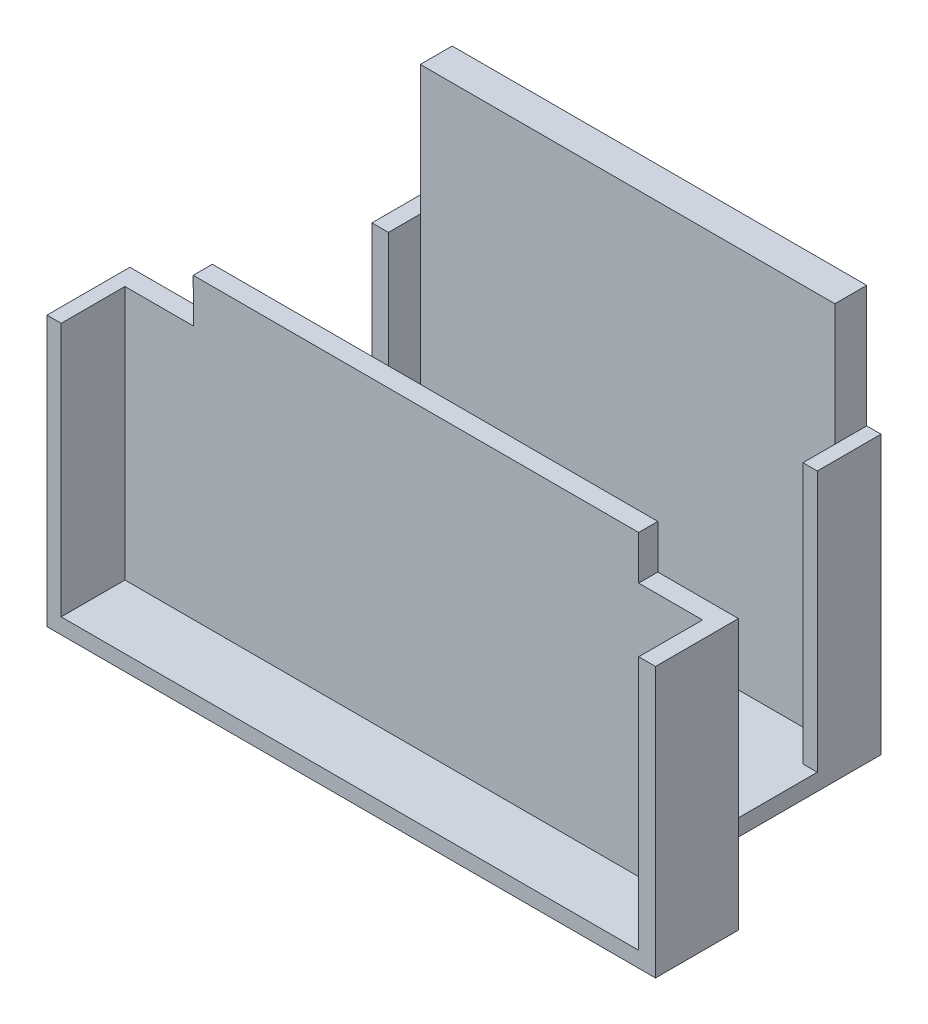
ISO-10303-21;
HEADER;
FILE_DESCRIPTION(('STEP AP214'),'2;1');
FILE_NAME('part.step','',(''),(''),'','','');
FILE_SCHEMA(('AUTOMOTIVE_DESIGN { 1 0 10303 214 1 1 1 1 }'));
ENDSEC;
DATA;
#1=APPLICATION_CONTEXT('core data for automotive mechanical design processes');
#2=APPLICATION_PROTOCOL_DEFINITION('international standard','automotive_design',2000,#1);
#3=PRODUCT_CONTEXT('',#1,'mechanical');
#4=PRODUCT('Part','Part','',(#3));
#5=PRODUCT_RELATED_PRODUCT_CATEGORY('part','',(#4));
#6=PRODUCT_DEFINITION_FORMATION('','',#4);
#7=PRODUCT_DEFINITION_CONTEXT('part definition',#1,'design');
#8=PRODUCT_DEFINITION('design','',#6,#7);
#9=PRODUCT_DEFINITION_SHAPE('','',#8);
#10=(LENGTH_UNIT() NAMED_UNIT(*) SI_UNIT(.MILLI.,.METRE.));
#11=(NAMED_UNIT(*) PLANE_ANGLE_UNIT() SI_UNIT($,.RADIAN.));
#12=(NAMED_UNIT(*) SI_UNIT($,.STERADIAN.) SOLID_ANGLE_UNIT());
#13=UNCERTAINTY_MEASURE_WITH_UNIT(LENGTH_MEASURE(1.E-05),#10,'distance_accuracy_value','');
#14=(GEOMETRIC_REPRESENTATION_CONTEXT(3) GLOBAL_UNCERTAINTY_ASSIGNED_CONTEXT((#13)) GLOBAL_UNIT_ASSIGNED_CONTEXT((#10,
#11,#12)) REPRESENTATION_CONTEXT('',''));
#15=CARTESIAN_POINT('',(0.,0.,0.));
#16=DIRECTION('',(0.,0.,1.));
#17=DIRECTION('',(1.,0.,0.));
#18=AXIS2_PLACEMENT_3D('',#15,#16,#17);
#19=CARTESIAN_POINT('',(0.,0.,38.));
#20=DIRECTION('',(0.,0.,1.));
#21=DIRECTION('',(1.,0.,0.));
#22=AXIS2_PLACEMENT_3D('',#19,#20,#21);
#23=PLANE('',#22);
#24=DIRECTION('',(1.,0.,0.));
#25=VECTOR('',#24,1.);
#26=CARTESIAN_POINT('',(0.,-16.8033230912976,38.));
#27=LINE('',#26,#25);
#28=CARTESIAN_POINT('',(-32.3877144448461,-16.8033230912976,38.));
#29=VERTEX_POINT('',#28);
#30=CARTESIAN_POINT('',(58.1736144722457,-16.8033230912976,38.));
#31=VERTEX_POINT('',#30);
#32=EDGE_CURVE('E106',#29,#31,#27,.T.);
#33=ORIENTED_EDGE('',*,*,#32,.T.);
#34=DIRECTION('',(0.,1.,0.));
#35=VECTOR('',#34,1.);
#36=CARTESIAN_POINT('',(58.1736144722457,0.,38.));
#37=LINE('',#36,#35);
#38=CARTESIAN_POINT('',(58.1736144722457,23.0615674408494,38.));
#39=VERTEX_POINT('',#38);
#40=EDGE_CURVE('E288',#31,#39,#37,.T.);
#41=ORIENTED_EDGE('',*,*,#40,.T.);
#42=DIRECTION('',(-1.,0.,0.));
#43=VECTOR('',#42,1.);
#44=CARTESIAN_POINT('',(60.8040688063837,23.0615674408494,38.));
#45=LINE('',#44,#43);
#46=CARTESIAN_POINT('',(48.1691411178828,23.0615674408494,38.));
#47=VERTEX_POINT('',#46);
#48=EDGE_CURVE('E311',#39,#47,#45,.T.);
#49=ORIENTED_EDGE('',*,*,#48,.T.);
#50=DIRECTION('',(0.,1.,0.));
#51=VECTOR('',#50,1.);
#52=CARTESIAN_POINT('',(48.1691411178828,23.0615674408494,38.));
#53=LINE('',#52,#51);
#54=CARTESIAN_POINT('',(48.1691411178828,29.9376057969843,38.));
#55=VERTEX_POINT('',#54);
#56=EDGE_CURVE('E313',#47,#55,#53,.T.);
#57=ORIENTED_EDGE('',*,*,#56,.T.);
#58=DIRECTION('',(1.,0.,0.));
#59=VECTOR('',#58,1.);
#60=CARTESIAN_POINT('',(-21.6790919441443,29.9376057969843,38.));
#61=LINE('',#60,#59);
#62=CARTESIAN_POINT('',(-21.6790919441443,29.9376057969843,38.));
#63=VERTEX_POINT('',#62);
#64=EDGE_CURVE('E316',#63,#55,#61,.T.);
#65=ORIENTED_EDGE('',*,*,#64,.F.);
#66=DIRECTION('',(-0.00187809054826046,0.999998236386391,0.));
#67=VECTOR('',#66,1.);
#68=CARTESIAN_POINT('',(-21.6661780987231,23.0615674408494,38.));
#69=LINE('',#68,#67);
#70=CARTESIAN_POINT('',(-21.6661780987231,23.0615674408494,38.));
#71=VERTEX_POINT('',#70);
#72=EDGE_CURVE('E319',#71,#63,#69,.T.);
#73=ORIENTED_EDGE('',*,*,#72,.F.);
#74=DIRECTION('',(-1.,0.,0.));
#75=VECTOR('',#74,1.);
#76=CARTESIAN_POINT('',(-21.6661780987231,23.0615674408494,38.));
#77=LINE('',#76,#75);
#78=CARTESIAN_POINT('',(-32.3877144448461,23.0615674408494,38.));
#79=VERTEX_POINT('',#78);
#80=EDGE_CURVE('E322',#71,#79,#77,.T.);
#81=ORIENTED_EDGE('',*,*,#80,.T.);
#82=DIRECTION('',(0.,-1.,0.));
#83=VECTOR('',#82,1.);
#84=CARTESIAN_POINT('',(-32.3877144448461,23.0615674408494,38.));
#85=LINE('',#84,#83);
#86=EDGE_CURVE('E282',#79,#29,#85,.T.);
#87=ORIENTED_EDGE('',*,*,#86,.T.);
#88=EDGE_LOOP('',(#33,#41,#49,#57,#65,#73,#81,#87));
#89=FACE_BOUND('',#88,.T.);
#90=ADVANCED_FACE('F91',(#89),#23,.T.);
#91=CARTESIAN_POINT('',(-19.0734380843407,0.,5.));
#92=DIRECTION('',(1.,0.,0.));
#93=DIRECTION('',(0.,1.,0.));
#94=AXIS2_PLACEMENT_3D('',#91,#92,#93);
#95=PLANE('',#94);
#96=DIRECTION('',(0.,0.,-1.));
#97=VECTOR('',#96,1.);
#98=CARTESIAN_POINT('',(-19.0734380843407,23.0615674408494,10.));
#99=LINE('',#98,#97);
#100=CARTESIAN_POINT('',(-19.0734380843407,23.0615674408494,5.));
#101=VERTEX_POINT('',#100);
#102=CARTESIAN_POINT('',(-19.0734380843407,23.0615674408494,0.));
#103=VERTEX_POINT('',#102);
#104=EDGE_CURVE('E99',#101,#103,#99,.T.);
#105=ORIENTED_EDGE('',*,*,#104,.F.);
#106=DIRECTION('',(0.,-1.,0.));
#107=VECTOR('',#106,1.);
#108=CARTESIAN_POINT('',(-19.0734380843407,0.,5.));
#109=LINE('',#108,#107);
#110=CARTESIAN_POINT('',(-19.0734380843407,43.3745188868177,5.));
#111=VERTEX_POINT('',#110);
#112=EDGE_CURVE('E450',#111,#101,#109,.T.);
#113=ORIENTED_EDGE('',*,*,#112,.F.);
#114=DIRECTION('',(0.,0.,-1.));
#115=VECTOR('',#114,1.);
#116=CARTESIAN_POINT('',(-19.0734380843407,43.3745188868177,5.));
#117=LINE('',#116,#115);
#118=CARTESIAN_POINT('',(-19.0734380843407,43.3745188868177,0.));
#119=VERTEX_POINT('',#118);
#120=EDGE_CURVE('E455',#111,#119,#117,.T.);
#121=ORIENTED_EDGE('',*,*,#120,.T.);
#122=DIRECTION('',(0.,-1.,0.));
#123=VECTOR('',#122,1.);
#124=CARTESIAN_POINT('',(-19.0734380843407,0.,0.));
#125=LINE('',#124,#123);
#126=EDGE_CURVE('E461',#119,#103,#125,.T.);
#127=ORIENTED_EDGE('',*,*,#126,.T.);
#128=EDGE_LOOP('',(#105,#113,#121,#127));
#129=FACE_BOUND('',#128,.T.);
#130=ADVANCED_FACE('F495',(#129),#95,.F.);
#131=CARTESIAN_POINT('',(45.9265619156593,0.,5.));
#132=DIRECTION('',(1.,0.,0.));
#133=DIRECTION('',(0.,1.,0.));
#134=AXIS2_PLACEMENT_3D('',#131,#132,#133);
#135=PLANE('',#134);
#136=DIRECTION('',(0.,-1.,0.));
#137=VECTOR('',#136,1.);
#138=CARTESIAN_POINT('',(45.9265619156593,0.,5.));
#139=LINE('',#138,#137);
#140=CARTESIAN_POINT('',(45.9265619156593,43.3745188868177,5.));
#141=VERTEX_POINT('',#140);
#142=CARTESIAN_POINT('',(45.9265619156593,24.287776118575,5.));
#143=VERTEX_POINT('',#142);
#144=EDGE_CURVE('E442',#141,#143,#139,.T.);
#145=ORIENTED_EDGE('',*,*,#144,.T.);
#146=DIRECTION('',(0.,0.,-1.));
#147=VECTOR('',#146,1.);
#148=CARTESIAN_POINT('',(45.9265619156593,24.287776118575,10.));
#149=LINE('',#148,#147);
#150=CARTESIAN_POINT('',(45.9265619156593,24.287776118575,0.));
#151=VERTEX_POINT('',#150);
#152=EDGE_CURVE('E441',#143,#151,#149,.T.);
#153=ORIENTED_EDGE('',*,*,#152,.T.);
#154=DIRECTION('',(0.,-1.,0.));
#155=VECTOR('',#154,1.);
#156=CARTESIAN_POINT('',(45.9265619156593,0.,0.));
#157=LINE('',#156,#155);
#158=CARTESIAN_POINT('',(45.9265619156593,43.3745188868177,0.));
#159=VERTEX_POINT('',#158);
#160=EDGE_CURVE('E436',#159,#151,#157,.T.);
#161=ORIENTED_EDGE('',*,*,#160,.F.);
#162=DIRECTION('',(0.,0.,-1.));
#163=VECTOR('',#162,1.);
#164=CARTESIAN_POINT('',(45.9265619156593,43.3745188868177,5.));
#165=LINE('',#164,#163);
#166=EDGE_CURVE('E463',#141,#159,#165,.T.);
#167=ORIENTED_EDGE('',*,*,#166,.F.);
#168=EDGE_LOOP('',(#145,#153,#161,#167));
#169=FACE_BOUND('',#168,.T.);
#170=ADVANCED_FACE('F93',(#169),#135,.T.);
#171=CARTESIAN_POINT('',(0.,0.,0.));
#172=DIRECTION('',(0.,0.,1.));
#173=DIRECTION('',(1.,0.,0.));
#174=AXIS2_PLACEMENT_3D('',#171,#172,#173);
#175=PLANE('',#174);
#176=DIRECTION('',(1.,0.,0.));
#177=VECTOR('',#176,1.);
#178=CARTESIAN_POINT('',(48.1691411178828,-16.6254811131823,0.));
#179=LINE('',#178,#177);
#180=CARTESIAN_POINT('',(-21.6790919441443,-16.6254811131823,0.));
#181=VERTEX_POINT('',#180);
#182=CARTESIAN_POINT('',(-21.6661780987231,-16.6254811131823,0.));
#183=VERTEX_POINT('',#182);
#184=EDGE_CURVE('E371',#181,#183,#179,.T.);
#185=ORIENTED_EDGE('',*,*,#184,.T.);
#186=DIRECTION('',(0.,1.,0.));
#187=VECTOR('',#186,1.);
#188=CARTESIAN_POINT('',(-21.6661780987231,23.0615674408494,0.));
#189=LINE('',#188,#187);
#190=CARTESIAN_POINT('',(-21.6661780987231,23.0615674408494,0.));
#191=VERTEX_POINT('',#190);
#192=EDGE_CURVE('E395',#183,#191,#189,.T.);
#193=ORIENTED_EDGE('',*,*,#192,.T.);
#194=DIRECTION('',(1.,0.,0.));
#195=VECTOR('',#194,1.);
#196=CARTESIAN_POINT('',(-19.0734380843407,23.0615674408494,0.));
#197=LINE('',#196,#195);
#198=EDGE_CURVE('E399',#191,#103,#197,.T.);
#199=ORIENTED_EDGE('',*,*,#198,.T.);
#200=ORIENTED_EDGE('',*,*,#126,.F.);
#201=DIRECTION('',(1.,0.,0.));
#202=VECTOR('',#201,1.);
#203=CARTESIAN_POINT('',(0.,43.3745188868177,0.));
#204=LINE('',#203,#202);
#205=EDGE_CURVE('E458',#119,#159,#204,.T.);
#206=ORIENTED_EDGE('',*,*,#205,.T.);
#207=ORIENTED_EDGE('',*,*,#160,.T.);
#208=DIRECTION('',(1.,0.,0.));
#209=VECTOR('',#208,1.);
#210=CARTESIAN_POINT('',(45.9265619156593,24.287776118575,0.));
#211=LINE('',#210,#209);
#212=CARTESIAN_POINT('',(48.1691411178828,24.287776118575,0.));
#213=VERTEX_POINT('',#212);
#214=EDGE_CURVE('E412',#151,#213,#211,.T.);
#215=ORIENTED_EDGE('',*,*,#214,.T.);
#216=DIRECTION('',(0.,-1.,0.));
#217=VECTOR('',#216,1.);
#218=CARTESIAN_POINT('',(48.1691411178828,24.287776118575,0.));
#219=LINE('',#218,#217);
#220=CARTESIAN_POINT('',(48.1691411178828,-19.2456791514069,0.));
#221=VERTEX_POINT('',#220);
#222=EDGE_CURVE('E422',#213,#221,#219,.T.);
#223=ORIENTED_EDGE('',*,*,#222,.T.);
#224=DIRECTION('',(-1.,0.,0.));
#225=VECTOR('',#224,1.);
#226=CARTESIAN_POINT('',(48.1691411178828,-19.2456791514069,0.));
#227=LINE('',#226,#225);
#228=CARTESIAN_POINT('',(-21.6790919441443,-19.2456791514069,0.));
#229=VERTEX_POINT('',#228);
#230=EDGE_CURVE('E366',#221,#229,#227,.T.);
#231=ORIENTED_EDGE('',*,*,#230,.T.);
#232=DIRECTION('',(0.,1.,0.));
#233=VECTOR('',#232,1.);
#234=CARTESIAN_POINT('',(-21.6790919441443,-16.6254811131823,0.));
#235=LINE('',#234,#233);
#236=EDGE_CURVE('E380',#229,#181,#235,.T.);
#237=ORIENTED_EDGE('',*,*,#236,.T.);
#238=EDGE_LOOP('',(#185,#193,#199,#200,#206,#207,#215,#223,#231,#237));
#239=FACE_BOUND('',#238,.T.);
#240=ADVANCED_FACE('F475',(#239),#175,.F.);
#241=CARTESIAN_POINT('',(0.,43.3745188868177,5.));
#242=DIRECTION('',(0.,1.,0.));
#243=DIRECTION('',(0.,0.,1.));
#244=AXIS2_PLACEMENT_3D('',#241,#242,#243);
#245=PLANE('',#244);
#246=ORIENTED_EDGE('',*,*,#205,.F.);
#247=ORIENTED_EDGE('',*,*,#120,.F.);
#248=DIRECTION('',(1.,0.,0.));
#249=VECTOR('',#248,1.);
#250=CARTESIAN_POINT('',(0.,43.3745188868177,5.));
#251=LINE('',#250,#249);
#252=EDGE_CURVE('E445',#111,#141,#251,.T.);
#253=ORIENTED_EDGE('',*,*,#252,.T.);
#254=ORIENTED_EDGE('',*,*,#166,.T.);
#255=EDGE_LOOP('',(#246,#247,#253,#254));
#256=FACE_BOUND('',#255,.T.);
#257=ADVANCED_FACE('F496',(#256),#245,.T.);
#258=CARTESIAN_POINT('',(0.,0.,5.));
#259=DIRECTION('',(0.,0.,1.));
#260=DIRECTION('',(1.,0.,0.));
#261=AXIS2_PLACEMENT_3D('',#258,#259,#260);
#262=PLANE('',#261);
#263=ORIENTED_EDGE('',*,*,#144,.F.);
#264=ORIENTED_EDGE('',*,*,#252,.F.);
#265=ORIENTED_EDGE('',*,*,#112,.T.);
#266=CARTESIAN_POINT('',(-19.0734380843407,-16.6254811131823,5.));
#267=VERTEX_POINT('',#266);
#268=EDGE_CURVE('E449',#101,#267,#109,.T.);
#269=ORIENTED_EDGE('',*,*,#268,.T.);
#270=DIRECTION('',(1.,0.,0.));
#271=VECTOR('',#270,1.);
#272=CARTESIAN_POINT('',(0.,-16.6254811131823,5.));
#273=LINE('',#272,#271);
#274=CARTESIAN_POINT('',(45.9265619156593,-16.6254811131823,5.));
#275=VERTEX_POINT('',#274);
#276=EDGE_CURVE('E452',#267,#275,#273,.T.);
#277=ORIENTED_EDGE('',*,*,#276,.T.);
#278=EDGE_CURVE('E446',#143,#275,#139,.T.);
#279=ORIENTED_EDGE('',*,*,#278,.F.);
#280=EDGE_LOOP('',(#263,#264,#265,#269,#277,#279));
#281=FACE_BOUND('',#280,.T.);
#282=ADVANCED_FACE('F492',(#281),#262,.T.);
#283=CARTESIAN_POINT('',(45.9265619156593,24.287776118575,10.));
#284=DIRECTION('',(-1.,0.,0.));
#285=DIRECTION('',(0.,-1.,0.));
#286=AXIS2_PLACEMENT_3D('',#283,#284,#285);
#287=PLANE('',#286);
#288=CARTESIAN_POINT('',(45.9265619156593,24.287776118575,10.));
#289=VERTEX_POINT('',#288);
#290=EDGE_CURVE('E430',#289,#143,#149,.T.);
#291=ORIENTED_EDGE('',*,*,#290,.T.);
#292=ORIENTED_EDGE('',*,*,#278,.T.);
#293=DIRECTION('',(0.,0.,-1.));
#294=VECTOR('',#293,1.);
#295=CARTESIAN_POINT('',(45.9265619156593,-16.6254811131823,10.));
#296=LINE('',#295,#294);
#297=CARTESIAN_POINT('',(45.9265619156593,-16.6254811131823,10.));
#298=VERTEX_POINT('',#297);
#299=EDGE_CURVE('E434',#298,#275,#296,.T.);
#300=ORIENTED_EDGE('',*,*,#299,.F.);
#301=DIRECTION('',(0.,1.,0.));
#302=VECTOR('',#301,1.);
#303=CARTESIAN_POINT('',(45.9265619156593,24.287776118575,10.));
#304=LINE('',#303,#302);
#305=EDGE_CURVE('E418',#298,#289,#304,.T.);
#306=ORIENTED_EDGE('',*,*,#305,.T.);
#307=EDGE_LOOP('',(#291,#292,#300,#306));
#308=FACE_BOUND('',#307,.T.);
#309=ADVANCED_FACE('F500',(#308),#287,.T.);
#310=CARTESIAN_POINT('',(48.1691411178828,24.287776118575,10.));
#311=DIRECTION('',(1.,0.,0.));
#312=DIRECTION('',(0.,0.,-1.));
#313=AXIS2_PLACEMENT_3D('',#310,#311,#312);
#314=PLANE('',#313);
#315=ORIENTED_EDGE('',*,*,#222,.F.);
#316=DIRECTION('',(0.,0.,-1.));
#317=VECTOR('',#316,1.);
#318=CARTESIAN_POINT('',(48.1691411178828,24.287776118575,10.));
#319=LINE('',#318,#317);
#320=CARTESIAN_POINT('',(48.1691411178828,24.287776118575,10.));
#321=VERTEX_POINT('',#320);
#322=EDGE_CURVE('E437',#321,#213,#319,.T.);
#323=ORIENTED_EDGE('',*,*,#322,.F.);
#324=DIRECTION('',(0.,-1.,0.));
#325=VECTOR('',#324,1.);
#326=CARTESIAN_POINT('',(48.1691411178828,24.287776118575,10.));
#327=LINE('',#326,#325);
#328=CARTESIAN_POINT('',(48.1691411178828,-16.6254811131823,10.));
#329=VERTEX_POINT('',#328);
#330=EDGE_CURVE('E425',#321,#329,#327,.T.);
#331=ORIENTED_EDGE('',*,*,#330,.T.);
#332=DIRECTION('',(0.,0.,-1.));
#333=VECTOR('',#332,1.);
#334=CARTESIAN_POINT('',(48.1691411178828,-16.6254811131823,35.));
#335=LINE('',#334,#333);
#336=CARTESIAN_POINT('',(48.1691411178828,-16.6254811131823,35.));
#337=VERTEX_POINT('',#336);
#338=EDGE_CURVE('E385',#337,#329,#335,.T.);
#339=ORIENTED_EDGE('',*,*,#338,.F.);
#340=DIRECTION('',(0.,-1.,0.));
#341=VECTOR('',#340,1.);
#342=CARTESIAN_POINT('',(48.1691411178828,-16.6254811131823,35.));
#343=LINE('',#342,#341);
#344=CARTESIAN_POINT('',(48.1691411178828,-19.2456791514069,35.));
#345=VERTEX_POINT('',#344);
#346=EDGE_CURVE('E367',#337,#345,#343,.T.);
#347=ORIENTED_EDGE('',*,*,#346,.T.);
#348=DIRECTION('',(0.,0.,-1.));
#349=VECTOR('',#348,1.);
#350=CARTESIAN_POINT('',(48.1691411178828,-19.2456791514069,35.));
#351=LINE('',#350,#349);
#352=EDGE_CURVE('E377',#345,#221,#351,.T.);
#353=ORIENTED_EDGE('',*,*,#352,.T.);
#354=EDGE_LOOP('',(#315,#323,#331,#339,#347,#353));
#355=FACE_BOUND('',#354,.T.);
#356=ADVANCED_FACE('F512',(#355),#314,.T.);
#357=CARTESIAN_POINT('',(45.9265619156593,24.287776118575,10.));
#358=DIRECTION('',(0.,1.,0.));
#359=DIRECTION('',(0.,0.,1.));
#360=AXIS2_PLACEMENT_3D('',#357,#358,#359);
#361=PLANE('',#360);
#362=ORIENTED_EDGE('',*,*,#214,.F.);
#363=ORIENTED_EDGE('',*,*,#152,.F.);
#364=ORIENTED_EDGE('',*,*,#290,.F.);
#365=DIRECTION('',(1.,0.,0.));
#366=VECTOR('',#365,1.);
#367=CARTESIAN_POINT('',(45.9265619156593,24.287776118575,10.));
#368=LINE('',#367,#366);
#369=EDGE_CURVE('E421',#289,#321,#368,.T.);
#370=ORIENTED_EDGE('',*,*,#369,.T.);
#371=ORIENTED_EDGE('',*,*,#322,.T.);
#372=EDGE_LOOP('',(#362,#363,#364,#370,#371));
#373=FACE_BOUND('',#372,.T.);
#374=ADVANCED_FACE('F504',(#373),#361,.T.);
#375=CARTESIAN_POINT('',(0.,0.,10.));
#376=DIRECTION('',(0.,0.,-1.));
#377=DIRECTION('',(-1.,0.,0.));
#378=AXIS2_PLACEMENT_3D('',#375,#376,#377);
#379=PLANE('',#378);
#380=ORIENTED_EDGE('',*,*,#305,.F.);
#381=DIRECTION('',(-1.,0.,0.));
#382=VECTOR('',#381,1.);
#383=CARTESIAN_POINT('',(48.1691411178828,-16.6254811131823,10.));
#384=LINE('',#383,#382);
#385=EDGE_CURVE('E428',#329,#298,#384,.T.);
#386=ORIENTED_EDGE('',*,*,#385,.F.);
#387=ORIENTED_EDGE('',*,*,#330,.F.);
#388=ORIENTED_EDGE('',*,*,#369,.F.);
#389=EDGE_LOOP('',(#380,#386,#387,#388));
#390=FACE_BOUND('',#389,.T.);
#391=ADVANCED_FACE('F507',(#390),#379,.F.);
#392=CARTESIAN_POINT('',(-19.0734380843407,23.0615674408494,10.));
#393=DIRECTION('',(1.,0.,0.));
#394=DIRECTION('',(0.,1.,0.));
#395=AXIS2_PLACEMENT_3D('',#392,#393,#394);
#396=PLANE('',#395);
#397=ORIENTED_EDGE('',*,*,#268,.F.);
#398=CARTESIAN_POINT('',(-19.0734380843407,23.0615674408494,10.));
#399=VERTEX_POINT('',#398);
#400=EDGE_CURVE('E413',#399,#101,#99,.T.);
#401=ORIENTED_EDGE('',*,*,#400,.F.);
#402=DIRECTION('',(0.,-1.,0.));
#403=VECTOR('',#402,1.);
#404=CARTESIAN_POINT('',(-19.0734380843407,23.0615674408494,10.));
#405=LINE('',#404,#403);
#406=CARTESIAN_POINT('',(-19.0734380843407,-16.6254811131823,10.));
#407=VERTEX_POINT('',#406);
#408=EDGE_CURVE('E402',#399,#407,#405,.T.);
#409=ORIENTED_EDGE('',*,*,#408,.T.);
#410=DIRECTION('',(0.,0.,-1.));
#411=VECTOR('',#410,1.);
#412=CARTESIAN_POINT('',(-19.0734380843407,-16.6254811131823,10.));
#413=LINE('',#412,#411);
#414=EDGE_CURVE('E409',#407,#267,#413,.T.);
#415=ORIENTED_EDGE('',*,*,#414,.T.);
#416=EDGE_LOOP('',(#397,#401,#409,#415));
#417=FACE_BOUND('',#416,.T.);
#418=ADVANCED_FACE('F488',(#417),#396,.T.);
#419=CARTESIAN_POINT('',(-19.0734380843407,23.0615674408494,10.));
#420=DIRECTION('',(0.,1.,0.));
#421=DIRECTION('',(0.,0.,1.));
#422=AXIS2_PLACEMENT_3D('',#419,#420,#421);
#423=PLANE('',#422);
#424=ORIENTED_EDGE('',*,*,#198,.F.);
#425=DIRECTION('',(0.,0.,-1.));
#426=VECTOR('',#425,1.);
#427=CARTESIAN_POINT('',(-21.6661780987231,23.0615674408494,10.));
#428=LINE('',#427,#426);
#429=CARTESIAN_POINT('',(-21.6661780987231,23.0615674408494,10.));
#430=VERTEX_POINT('',#429);
#431=EDGE_CURVE('E405',#430,#191,#428,.T.);
#432=ORIENTED_EDGE('',*,*,#431,.F.);
#433=DIRECTION('',(1.,0.,0.));
#434=VECTOR('',#433,1.);
#435=CARTESIAN_POINT('',(-19.0734380843407,23.0615674408494,10.));
#436=LINE('',#435,#434);
#437=EDGE_CURVE('E398',#430,#399,#436,.T.);
#438=ORIENTED_EDGE('',*,*,#437,.T.);
#439=ORIENTED_EDGE('',*,*,#400,.T.);
#440=ORIENTED_EDGE('',*,*,#104,.T.);
#441=EDGE_LOOP('',(#424,#432,#438,#439,#440));
#442=FACE_BOUND('',#441,.T.);
#443=ADVANCED_FACE('F471',(#442),#423,.T.);
#444=CARTESIAN_POINT('',(-21.6661780987231,23.0615674408494,10.));
#445=DIRECTION('',(-1.,0.,0.));
#446=DIRECTION('',(0.,0.,1.));
#447=AXIS2_PLACEMENT_3D('',#444,#445,#446);
#448=PLANE('',#447);
#449=DIRECTION('',(0.,0.,-1.));
#450=VECTOR('',#449,1.);
#451=CARTESIAN_POINT('',(-21.6661780987231,-16.6254811131823,10.));
#452=LINE('',#451,#450);
#453=CARTESIAN_POINT('',(-21.6661780987231,-16.6254811131823,10.));
#454=VERTEX_POINT('',#453);
#455=EDGE_CURVE('E387',#454,#183,#452,.T.);
#456=ORIENTED_EDGE('',*,*,#455,.F.);
#457=DIRECTION('',(0.,1.,0.));
#458=VECTOR('',#457,1.);
#459=CARTESIAN_POINT('',(-21.6661780987231,23.0615674408494,10.));
#460=LINE('',#459,#458);
#461=EDGE_CURVE('E396',#454,#430,#460,.T.);
#462=ORIENTED_EDGE('',*,*,#461,.T.);
#463=ORIENTED_EDGE('',*,*,#431,.T.);
#464=ORIENTED_EDGE('',*,*,#192,.F.);
#465=EDGE_LOOP('',(#456,#462,#463,#464));
#466=FACE_BOUND('',#465,.T.);
#467=ADVANCED_FACE('F480',(#466),#448,.T.);
#468=CARTESIAN_POINT('',(0.,0.,10.));
#469=DIRECTION('',(0.,0.,-1.));
#470=DIRECTION('',(-1.,0.,0.));
#471=AXIS2_PLACEMENT_3D('',#468,#469,#470);
#472=PLANE('',#471);
#473=ORIENTED_EDGE('',*,*,#461,.F.);
#474=DIRECTION('',(1.,0.,0.));
#475=VECTOR('',#474,1.);
#476=CARTESIAN_POINT('',(0.,-16.6254811131823,10.));
#477=LINE('',#476,#475);
#478=EDGE_CURVE('E12',#454,#407,#477,.T.);
#479=ORIENTED_EDGE('',*,*,#478,.T.);
#480=ORIENTED_EDGE('',*,*,#408,.F.);
#481=ORIENTED_EDGE('',*,*,#437,.F.);
#482=EDGE_LOOP('',(#473,#479,#480,#481));
#483=FACE_BOUND('',#482,.T.);
#484=ADVANCED_FACE('F485',(#483),#472,.F.);
#485=CARTESIAN_POINT('',(48.1691411178828,-16.6254811131823,35.));
#486=DIRECTION('',(0.,1.,0.));
#487=DIRECTION('',(0.,0.,1.));
#488=AXIS2_PLACEMENT_3D('',#485,#486,#487);
#489=PLANE('',#488);
#490=ORIENTED_EDGE('',*,*,#385,.T.);
#491=ORIENTED_EDGE('',*,*,#299,.T.);
#492=ORIENTED_EDGE('',*,*,#276,.F.);
#493=ORIENTED_EDGE('',*,*,#414,.F.);
#494=ORIENTED_EDGE('',*,*,#478,.F.);
#495=ORIENTED_EDGE('',*,*,#455,.T.);
#496=ORIENTED_EDGE('',*,*,#184,.F.);
#497=DIRECTION('',(0.,0.,-1.));
#498=VECTOR('',#497,1.);
#499=CARTESIAN_POINT('',(-21.6790919441443,-16.6254811131823,35.));
#500=LINE('',#499,#498);
#501=CARTESIAN_POINT('',(-21.6790919441443,-16.6254811131823,35.));
#502=VERTEX_POINT('',#501);
#503=EDGE_CURVE('E388',#502,#181,#500,.T.);
#504=ORIENTED_EDGE('',*,*,#503,.F.);
#505=DIRECTION('',(1.,0.,0.));
#506=VECTOR('',#505,1.);
#507=CARTESIAN_POINT('',(48.1691411178828,-16.6254811131823,35.));
#508=LINE('',#507,#506);
#509=EDGE_CURVE('E374',#502,#337,#508,.T.);
#510=ORIENTED_EDGE('',*,*,#509,.T.);
#511=ORIENTED_EDGE('',*,*,#338,.T.);
#512=EDGE_LOOP('',(#490,#491,#492,#493,#494,#495,#496,#504,#510,#511));
#513=FACE_BOUND('',#512,.T.);
#514=ADVANCED_FACE('F523',(#513),#489,.T.);
#515=CARTESIAN_POINT('',(-21.6790919441443,-16.6254811131823,35.));
#516=DIRECTION('',(-1.,0.,0.));
#517=DIRECTION('',(0.,0.,1.));
#518=AXIS2_PLACEMENT_3D('',#515,#516,#517);
#519=PLANE('',#518);
#520=ORIENTED_EDGE('',*,*,#236,.F.);
#521=DIRECTION('',(0.,0.,-1.));
#522=VECTOR('',#521,1.);
#523=CARTESIAN_POINT('',(-21.6790919441443,-19.2456791514069,35.));
#524=LINE('',#523,#522);
#525=CARTESIAN_POINT('',(-21.6790919441443,-19.2456791514069,35.));
#526=VERTEX_POINT('',#525);
#527=EDGE_CURVE('E390',#526,#229,#524,.T.);
#528=ORIENTED_EDGE('',*,*,#527,.F.);
#529=DIRECTION('',(0.,1.,0.));
#530=VECTOR('',#529,1.);
#531=CARTESIAN_POINT('',(-21.6790919441443,-16.6254811131823,35.));
#532=LINE('',#531,#530);
#533=EDGE_CURVE('E370',#526,#502,#532,.T.);
#534=ORIENTED_EDGE('',*,*,#533,.T.);
#535=ORIENTED_EDGE('',*,*,#503,.T.);
#536=EDGE_LOOP('',(#520,#528,#534,#535));
#537=FACE_BOUND('',#536,.T.);
#538=ADVANCED_FACE('F520',(#537),#519,.T.);
#539=CARTESIAN_POINT('',(48.1691411178828,-19.2456791514069,35.));
#540=DIRECTION('',(0.,-1.,0.));
#541=DIRECTION('',(0.,0.,-1.));
#542=AXIS2_PLACEMENT_3D('',#539,#540,#541);
#543=PLANE('',#542);
#544=ORIENTED_EDGE('',*,*,#230,.F.);
#545=ORIENTED_EDGE('',*,*,#352,.F.);
#546=DIRECTION('',(1.,0.,0.));
#547=VECTOR('',#546,1.);
#548=CARTESIAN_POINT('',(48.1691411178828,-19.2456791514069,35.));
#549=LINE('',#548,#547);
#550=CARTESIAN_POINT('',(60.8040688063837,-19.2456791514069,35.));
#551=VERTEX_POINT('',#550);
#552=EDGE_CURVE('E271',#345,#551,#549,.T.);
#553=ORIENTED_EDGE('',*,*,#552,.T.);
#554=DIRECTION('',(0.,0.,-1.));
#555=VECTOR('',#554,1.);
#556=CARTESIAN_POINT('',(60.8040688063837,-19.2456791514069,38.));
#557=LINE('',#556,#555);
#558=CARTESIAN_POINT('',(60.8040688063837,-19.2456791514069,48.));
#559=VERTEX_POINT('',#558);
#560=EDGE_CURVE('E363',#559,#551,#557,.T.);
#561=ORIENTED_EDGE('',*,*,#560,.F.);
#562=DIRECTION('',(1.,0.,0.));
#563=VECTOR('',#562,1.);
#564=CARTESIAN_POINT('',(0.,-19.2456791514069,48.));
#565=LINE('',#564,#563);
#566=CARTESIAN_POINT('',(-34.6137615079782,-19.2456791514069,48.));
#567=VERTEX_POINT('',#566);
#568=EDGE_CURVE('E287',#567,#559,#565,.T.);
#569=ORIENTED_EDGE('',*,*,#568,.F.);
#570=DIRECTION('',(0.,0.,-1.));
#571=VECTOR('',#570,1.);
#572=CARTESIAN_POINT('',(-34.6137615079782,-19.2456791514069,38.));
#573=LINE('',#572,#571);
#574=CARTESIAN_POINT('',(-34.6137615079782,-19.2456791514069,35.));
#575=VERTEX_POINT('',#574);
#576=EDGE_CURVE('E325',#567,#575,#573,.T.);
#577=ORIENTED_EDGE('',*,*,#576,.T.);
#578=EDGE_CURVE('E326',#575,#526,#549,.T.);
#579=ORIENTED_EDGE('',*,*,#578,.T.);
#580=ORIENTED_EDGE('',*,*,#527,.T.);
#581=EDGE_LOOP('',(#544,#545,#553,#561,#569,#577,#579,#580));
#582=FACE_BOUND('',#581,.T.);
#583=ADVANCED_FACE('F517',(#582),#543,.T.);
#584=CARTESIAN_POINT('',(60.8040688063837,-19.2456791514069,38.));
#585=DIRECTION('',(-1.,0.,0.));
#586=DIRECTION('',(0.,0.,1.));
#587=AXIS2_PLACEMENT_3D('',#584,#585,#586);
#588=PLANE('',#587);
#589=DIRECTION('',(0.,1.,0.));
#590=VECTOR('',#589,1.);
#591=CARTESIAN_POINT('',(60.8040688063837,-19.2456791514069,35.));
#592=LINE('',#591,#590);
#593=CARTESIAN_POINT('',(60.8040688063837,23.0615674408494,35.));
#594=VERTEX_POINT('',#593);
#595=EDGE_CURVE('E329',#551,#594,#592,.T.);
#596=ORIENTED_EDGE('',*,*,#595,.T.);
#597=DIRECTION('',(0.,0.,-1.));
#598=VECTOR('',#597,1.);
#599=CARTESIAN_POINT('',(60.8040688063837,23.0615674408494,38.));
#600=LINE('',#599,#598);
#601=CARTESIAN_POINT('',(60.8040688063837,23.0615674408494,48.));
#602=VERTEX_POINT('',#601);
#603=EDGE_CURVE('E360',#602,#594,#600,.T.);
#604=ORIENTED_EDGE('',*,*,#603,.F.);
#605=DIRECTION('',(0.,1.,0.));
#606=VECTOR('',#605,1.);
#607=CARTESIAN_POINT('',(60.8040688063837,0.,48.));
#608=LINE('',#607,#606);
#609=EDGE_CURVE('E291',#559,#602,#608,.T.);
#610=ORIENTED_EDGE('',*,*,#609,.F.);
#611=ORIENTED_EDGE('',*,*,#560,.T.);
#612=EDGE_LOOP('',(#596,#604,#610,#611));
#613=FACE_BOUND('',#612,.T.);
#614=ADVANCED_FACE('F531',(#613),#588,.F.);
#615=CARTESIAN_POINT('',(60.8040688063837,23.0615674408494,38.));
#616=DIRECTION('',(0.,-1.,0.));
#617=DIRECTION('',(0.,0.,-1.));
#618=AXIS2_PLACEMENT_3D('',#615,#616,#617);
#619=PLANE('',#618);
#620=DIRECTION('',(-1.,0.,0.));
#621=VECTOR('',#620,1.);
#622=CARTESIAN_POINT('',(60.8040688063837,23.0615674408494,35.));
#623=LINE('',#622,#621);
#624=CARTESIAN_POINT('',(48.1691411178828,23.0615674408494,35.));
#625=VERTEX_POINT('',#624);
#626=EDGE_CURVE('E331',#594,#625,#623,.T.);
#627=ORIENTED_EDGE('',*,*,#626,.T.);
#628=DIRECTION('',(0.,0.,-1.));
#629=VECTOR('',#628,1.);
#630=CARTESIAN_POINT('',(48.1691411178828,23.0615674408494,38.));
#631=LINE('',#630,#629);
#632=EDGE_CURVE('E357',#47,#625,#631,.T.);
#633=ORIENTED_EDGE('',*,*,#632,.F.);
#634=ORIENTED_EDGE('',*,*,#48,.F.);
#635=DIRECTION('',(0.,0.,-1.));
#636=VECTOR('',#635,1.);
#637=CARTESIAN_POINT('',(58.1736144722457,23.0615674408494,48.));
#638=LINE('',#637,#636);
#639=CARTESIAN_POINT('',(58.1736144722457,23.0615674408494,48.));
#640=VERTEX_POINT('',#639);
#641=EDGE_CURVE('E272',#640,#39,#638,.T.);
#642=ORIENTED_EDGE('',*,*,#641,.F.);
#643=DIRECTION('',(-1.,0.,0.));
#644=VECTOR('',#643,1.);
#645=CARTESIAN_POINT('',(0.,23.0615674408494,48.));
#646=LINE('',#645,#644);
#647=EDGE_CURVE('E298',#602,#640,#646,.T.);
#648=ORIENTED_EDGE('',*,*,#647,.F.);
#649=ORIENTED_EDGE('',*,*,#603,.T.);
#650=EDGE_LOOP('',(#627,#633,#634,#642,#648,#649));
#651=FACE_BOUND('',#650,.T.);
#652=ADVANCED_FACE('F535',(#651),#619,.F.);
#653=CARTESIAN_POINT('',(48.1691411178828,23.0615674408494,38.));
#654=DIRECTION('',(-1.,0.,0.));
#655=DIRECTION('',(0.,0.,1.));
#656=AXIS2_PLACEMENT_3D('',#653,#654,#655);
#657=PLANE('',#656);
#658=DIRECTION('',(0.,1.,0.));
#659=VECTOR('',#658,1.);
#660=CARTESIAN_POINT('',(48.1691411178828,23.0615674408494,35.));
#661=LINE('',#660,#659);
#662=CARTESIAN_POINT('',(48.1691411178828,29.9376057969843,35.));
#663=VERTEX_POINT('',#662);
#664=EDGE_CURVE('E333',#625,#663,#661,.T.);
#665=ORIENTED_EDGE('',*,*,#664,.T.);
#666=DIRECTION('',(0.,0.,-1.));
#667=VECTOR('',#666,1.);
#668=CARTESIAN_POINT('',(48.1691411178828,29.9376057969843,38.));
#669=LINE('',#668,#667);
#670=EDGE_CURVE('E355',#55,#663,#669,.T.);
#671=ORIENTED_EDGE('',*,*,#670,.F.);
#672=ORIENTED_EDGE('',*,*,#56,.F.);
#673=ORIENTED_EDGE('',*,*,#632,.T.);
#674=EDGE_LOOP('',(#665,#671,#672,#673));
#675=FACE_BOUND('',#674,.T.);
#676=ADVANCED_FACE('F561',(#675),#657,.F.);
#677=CARTESIAN_POINT('',(-21.6790919441443,29.9376057969843,38.));
#678=DIRECTION('',(0.,1.,0.));
#679=DIRECTION('',(0.,0.,1.));
#680=AXIS2_PLACEMENT_3D('',#677,#678,#679);
#681=PLANE('',#680);
#682=DIRECTION('',(1.,0.,0.));
#683=VECTOR('',#682,1.);
#684=CARTESIAN_POINT('',(-21.6790919441443,29.9376057969843,35.));
#685=LINE('',#684,#683);
#686=CARTESIAN_POINT('',(-21.6790919441443,29.9376057969843,35.));
#687=VERTEX_POINT('',#686);
#688=EDGE_CURVE('E336',#687,#663,#685,.T.);
#689=ORIENTED_EDGE('',*,*,#688,.F.);
#690=DIRECTION('',(0.,0.,-1.));
#691=VECTOR('',#690,1.);
#692=CARTESIAN_POINT('',(-21.6790919441443,29.9376057969843,38.));
#693=LINE('',#692,#691);
#694=EDGE_CURVE('E353',#63,#687,#693,.T.);
#695=ORIENTED_EDGE('',*,*,#694,.F.);
#696=ORIENTED_EDGE('',*,*,#64,.T.);
#697=ORIENTED_EDGE('',*,*,#670,.T.);
#698=EDGE_LOOP('',(#689,#695,#696,#697));
#699=FACE_BOUND('',#698,.T.);
#700=ADVANCED_FACE('F557',(#699),#681,.T.);
#701=CARTESIAN_POINT('',(-21.6661780987231,23.0615674408494,38.));
#702=DIRECTION('',(-0.999998236386391,-0.00187809054826046,0.));
#703=DIRECTION('',(0.00187809054826046,-0.999998236386391,0.));
#704=AXIS2_PLACEMENT_3D('',#701,#702,#703);
#705=PLANE('',#704);
#706=DIRECTION('',(-0.00187809054826046,0.999998236386391,0.));
#707=VECTOR('',#706,1.);
#708=CARTESIAN_POINT('',(-21.6661780987231,23.0615674408494,35.));
#709=LINE('',#708,#707);
#710=CARTESIAN_POINT('',(-21.6661780987231,23.0615674408494,35.));
#711=VERTEX_POINT('',#710);
#712=EDGE_CURVE('E339',#711,#687,#709,.T.);
#713=ORIENTED_EDGE('',*,*,#712,.F.);
#714=DIRECTION('',(0.,0.,-1.));
#715=VECTOR('',#714,1.);
#716=CARTESIAN_POINT('',(-21.6661780987231,23.0615674408494,38.));
#717=LINE('',#716,#715);
#718=EDGE_CURVE('E351',#71,#711,#717,.T.);
#719=ORIENTED_EDGE('',*,*,#718,.F.);
#720=ORIENTED_EDGE('',*,*,#72,.T.);
#721=ORIENTED_EDGE('',*,*,#694,.T.);
#722=EDGE_LOOP('',(#713,#719,#720,#721));
#723=FACE_BOUND('',#722,.T.);
#724=ADVANCED_FACE('F554',(#723),#705,.T.);
#725=CARTESIAN_POINT('',(-21.6661780987231,23.0615674408494,38.));
#726=DIRECTION('',(0.,-1.,0.));
#727=DIRECTION('',(0.,0.,-1.));
#728=AXIS2_PLACEMENT_3D('',#725,#726,#727);
#729=PLANE('',#728);
#730=DIRECTION('',(-1.,0.,0.));
#731=VECTOR('',#730,1.);
#732=CARTESIAN_POINT('',(-21.6661780987231,23.0615674408494,35.));
#733=LINE('',#732,#731);
#734=CARTESIAN_POINT('',(-34.6137615079782,23.0615674408494,35.));
#735=VERTEX_POINT('',#734);
#736=EDGE_CURVE('E342',#711,#735,#733,.T.);
#737=ORIENTED_EDGE('',*,*,#736,.T.);
#738=DIRECTION('',(0.,0.,-1.));
#739=VECTOR('',#738,1.);
#740=CARTESIAN_POINT('',(-34.6137615079782,23.0615674408494,38.));
#741=LINE('',#740,#739);
#742=CARTESIAN_POINT('',(-34.6137615079782,23.0615674408494,48.));
#743=VERTEX_POINT('',#742);
#744=EDGE_CURVE('E348',#743,#735,#741,.T.);
#745=ORIENTED_EDGE('',*,*,#744,.F.);
#746=DIRECTION('',(1.,0.,0.));
#747=VECTOR('',#746,1.);
#748=CARTESIAN_POINT('',(-34.6137615079782,23.0615674408494,48.));
#749=LINE('',#748,#747);
#750=CARTESIAN_POINT('',(-32.3877144448461,23.0615674408494,48.));
#751=VERTEX_POINT('',#750);
#752=EDGE_CURVE('E281',#743,#751,#749,.T.);
#753=ORIENTED_EDGE('',*,*,#752,.T.);
#754=DIRECTION('',(0.,0.,-1.));
#755=VECTOR('',#754,1.);
#756=CARTESIAN_POINT('',(-32.3877144448461,23.0615674408494,48.));
#757=LINE('',#756,#755);
#758=EDGE_CURVE('E277',#751,#79,#757,.T.);
#759=ORIENTED_EDGE('',*,*,#758,.T.);
#760=ORIENTED_EDGE('',*,*,#80,.F.);
#761=ORIENTED_EDGE('',*,*,#718,.T.);
#762=EDGE_LOOP('',(#737,#745,#753,#759,#760,#761));
#763=FACE_BOUND('',#762,.T.);
#764=ADVANCED_FACE('F546',(#763),#729,.F.);
#765=CARTESIAN_POINT('',(-34.6137615079782,23.0615674408494,38.));
#766=DIRECTION('',(1.,0.,0.));
#767=DIRECTION('',(0.,0.,-1.));
#768=AXIS2_PLACEMENT_3D('',#765,#766,#767);
#769=PLANE('',#768);
#770=DIRECTION('',(0.,-1.,0.));
#771=VECTOR('',#770,1.);
#772=CARTESIAN_POINT('',(-34.6137615079782,23.0615674408494,35.));
#773=LINE('',#772,#771);
#774=EDGE_CURVE('E314',#735,#575,#773,.T.);
#775=ORIENTED_EDGE('',*,*,#774,.T.);
#776=ORIENTED_EDGE('',*,*,#576,.F.);
#777=DIRECTION('',(0.,-1.,0.));
#778=VECTOR('',#777,1.);
#779=CARTESIAN_POINT('',(-34.6137615079782,23.0615674408494,48.));
#780=LINE('',#779,#778);
#781=EDGE_CURVE('E306',#743,#567,#780,.T.);
#782=ORIENTED_EDGE('',*,*,#781,.F.);
#783=ORIENTED_EDGE('',*,*,#744,.T.);
#784=EDGE_LOOP('',(#775,#776,#782,#783));
#785=FACE_BOUND('',#784,.T.);
#786=ADVANCED_FACE('F550',(#785),#769,.F.);
#787=CARTESIAN_POINT('',(0.,0.,35.));
#788=DIRECTION('',(0.,0.,1.));
#789=DIRECTION('',(1.,0.,0.));
#790=AXIS2_PLACEMENT_3D('',#787,#788,#789);
#791=PLANE('',#790);
#792=ORIENTED_EDGE('',*,*,#346,.F.);
#793=ORIENTED_EDGE('',*,*,#509,.F.);
#794=ORIENTED_EDGE('',*,*,#533,.F.);
#795=ORIENTED_EDGE('',*,*,#578,.F.);
#796=ORIENTED_EDGE('',*,*,#774,.F.);
#797=ORIENTED_EDGE('',*,*,#736,.F.);
#798=ORIENTED_EDGE('',*,*,#712,.T.);
#799=ORIENTED_EDGE('',*,*,#688,.T.);
#800=ORIENTED_EDGE('',*,*,#664,.F.);
#801=ORIENTED_EDGE('',*,*,#626,.F.);
#802=ORIENTED_EDGE('',*,*,#595,.F.);
#803=ORIENTED_EDGE('',*,*,#552,.F.);
#804=EDGE_LOOP('',(#792,#793,#794,#795,#796,#797,#798,#799,#800,#801,#802,#803));
#805=FACE_BOUND('',#804,.T.);
#806=ADVANCED_FACE('F525',(#805),#791,.F.);
#807=CARTESIAN_POINT('',(0.,-16.8033230912976,48.));
#808=DIRECTION('',(0.,1.,0.));
#809=DIRECTION('',(0.,0.,1.));
#810=AXIS2_PLACEMENT_3D('',#807,#808,#809);
#811=PLANE('',#810);
#812=ORIENTED_EDGE('',*,*,#32,.F.);
#813=DIRECTION('',(0.,0.,-1.));
#814=VECTOR('',#813,1.);
#815=CARTESIAN_POINT('',(-32.3877144448461,-16.8033230912976,48.));
#816=LINE('',#815,#814);
#817=CARTESIAN_POINT('',(-32.3877144448461,-16.8033230912976,48.));
#818=VERTEX_POINT('',#817);
#819=EDGE_CURVE('E262',#818,#29,#816,.T.);
#820=ORIENTED_EDGE('',*,*,#819,.F.);
#821=DIRECTION('',(1.,0.,0.));
#822=VECTOR('',#821,1.);
#823=CARTESIAN_POINT('',(0.,-16.8033230912976,48.));
#824=LINE('',#823,#822);
#825=CARTESIAN_POINT('',(58.1736144722457,-16.8033230912976,48.));
#826=VERTEX_POINT('',#825);
#827=EDGE_CURVE('E266',#818,#826,#824,.T.);
#828=ORIENTED_EDGE('',*,*,#827,.T.);
#829=DIRECTION('',(0.,0.,-1.));
#830=VECTOR('',#829,1.);
#831=CARTESIAN_POINT('',(58.1736144722457,-16.8033230912976,48.));
#832=LINE('',#831,#830);
#833=EDGE_CURVE('E301',#826,#31,#832,.T.);
#834=ORIENTED_EDGE('',*,*,#833,.T.);
#835=EDGE_LOOP('',(#812,#820,#828,#834));
#836=FACE_BOUND('',#835,.T.);
#837=ADVANCED_FACE('F264',(#836),#811,.T.);
#838=CARTESIAN_POINT('',(58.1736144722457,0.,48.));
#839=DIRECTION('',(-1.,0.,0.));
#840=DIRECTION('',(0.,0.,1.));
#841=AXIS2_PLACEMENT_3D('',#838,#839,#840);
#842=PLANE('',#841);
#843=ORIENTED_EDGE('',*,*,#40,.F.);
#844=ORIENTED_EDGE('',*,*,#833,.F.);
#845=DIRECTION('',(0.,1.,0.));
#846=VECTOR('',#845,1.);
#847=CARTESIAN_POINT('',(58.1736144722457,0.,48.));
#848=LINE('',#847,#846);
#849=EDGE_CURVE('E286',#826,#640,#848,.T.);
#850=ORIENTED_EDGE('',*,*,#849,.T.);
#851=ORIENTED_EDGE('',*,*,#641,.T.);
#852=EDGE_LOOP('',(#843,#844,#850,#851));
#853=FACE_BOUND('',#852,.T.);
#854=ADVANCED_FACE('F540',(#853),#842,.T.);
#855=CARTESIAN_POINT('',(0.,0.,48.));
#856=DIRECTION('',(0.,0.,1.));
#857=DIRECTION('',(1.,0.,0.));
#858=AXIS2_PLACEMENT_3D('',#855,#856,#857);
#859=PLANE('',#858);
#860=ORIENTED_EDGE('',*,*,#827,.F.);
#861=DIRECTION('',(0.,-1.,0.));
#862=VECTOR('',#861,1.);
#863=CARTESIAN_POINT('',(-32.3877144448461,23.0615674408494,48.));
#864=LINE('',#863,#862);
#865=EDGE_CURVE('E275',#751,#818,#864,.T.);
#866=ORIENTED_EDGE('',*,*,#865,.F.);
#867=ORIENTED_EDGE('',*,*,#752,.F.);
#868=ORIENTED_EDGE('',*,*,#781,.T.);
#869=ORIENTED_EDGE('',*,*,#568,.T.);
#870=ORIENTED_EDGE('',*,*,#609,.T.);
#871=ORIENTED_EDGE('',*,*,#647,.T.);
#872=ORIENTED_EDGE('',*,*,#849,.F.);
#873=EDGE_LOOP('',(#860,#866,#867,#868,#869,#870,#871,#872));
#874=FACE_BOUND('',#873,.T.);
#875=ADVANCED_FACE('F284',(#874),#859,.T.);
#876=CARTESIAN_POINT('',(-32.3877144448461,23.0615674408494,48.));
#877=DIRECTION('',(1.,0.,0.));
#878=DIRECTION('',(0.,0.,-1.));
#879=AXIS2_PLACEMENT_3D('',#876,#877,#878);
#880=PLANE('',#879);
#881=ORIENTED_EDGE('',*,*,#865,.T.);
#882=ORIENTED_EDGE('',*,*,#819,.T.);
#883=ORIENTED_EDGE('',*,*,#86,.F.);
#884=ORIENTED_EDGE('',*,*,#758,.F.);
#885=EDGE_LOOP('',(#881,#882,#883,#884));
#886=FACE_BOUND('',#885,.T.);
#887=ADVANCED_FACE('F276',(#886),#880,.T.);
#888=CLOSED_SHELL('',(#90,#130,#170,#240,#257,#282,#309,#356,#374,#391,#418,#443,#467,#484,#514,
#538,#583,#614,#652,#676,#700,#724,#764,#786,#806,#837,#854,#875,#887));
#889=MANIFOLD_SOLID_BREP('B2',#888);
#890=ADVANCED_BREP_SHAPE_REPRESENTATION('',(#18,#889),#14);
#891=SHAPE_DEFINITION_REPRESENTATION(#9,#890);
ENDSEC;
END-ISO-10303-21;
